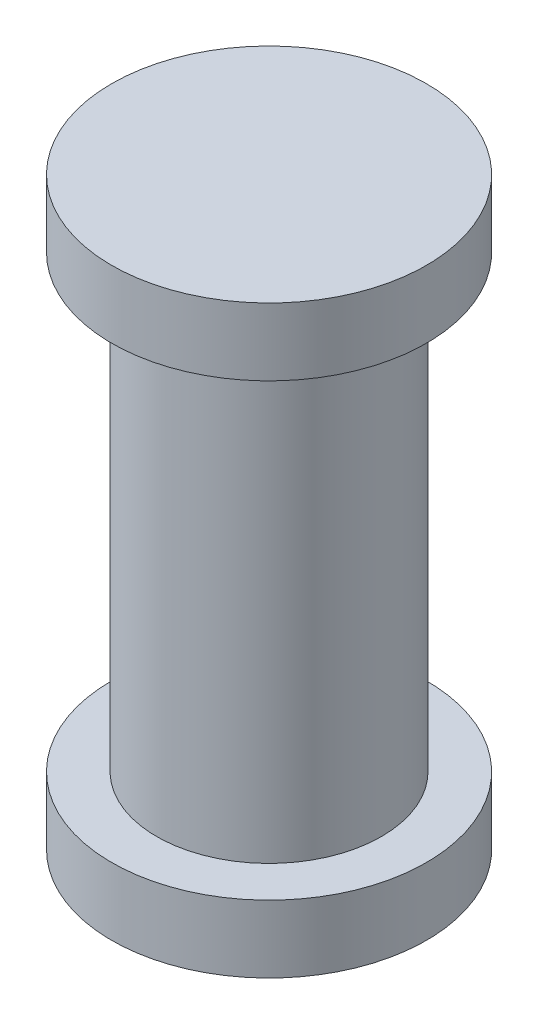
ISO-10303-21;
HEADER;
FILE_DESCRIPTION(('STEP AP214'),'2;1');
FILE_NAME('part.step','',(''),(''),'','','');
FILE_SCHEMA(('AUTOMOTIVE_DESIGN { 1 0 10303 214 1 1 1 1 }'));
ENDSEC;
DATA;
#1=APPLICATION_CONTEXT('core data for automotive mechanical design processes');
#2=APPLICATION_PROTOCOL_DEFINITION('international standard','automotive_design',2000,#1);
#3=PRODUCT_CONTEXT('',#1,'mechanical');
#4=PRODUCT('Part','Part','',(#3));
#5=PRODUCT_RELATED_PRODUCT_CATEGORY('part','',(#4));
#6=PRODUCT_DEFINITION_FORMATION('','',#4);
#7=PRODUCT_DEFINITION_CONTEXT('part definition',#1,'design');
#8=PRODUCT_DEFINITION('design','',#6,#7);
#9=PRODUCT_DEFINITION_SHAPE('','',#8);
#10=(LENGTH_UNIT() NAMED_UNIT(*) SI_UNIT(.MILLI.,.METRE.));
#11=(NAMED_UNIT(*) PLANE_ANGLE_UNIT() SI_UNIT($,.RADIAN.));
#12=(NAMED_UNIT(*) SI_UNIT($,.STERADIAN.) SOLID_ANGLE_UNIT());
#13=UNCERTAINTY_MEASURE_WITH_UNIT(LENGTH_MEASURE(1.E-05),#10,'distance_accuracy_value','');
#14=(GEOMETRIC_REPRESENTATION_CONTEXT(3) GLOBAL_UNCERTAINTY_ASSIGNED_CONTEXT((#13)) GLOBAL_UNIT_ASSIGNED_CONTEXT((#10,
#11,#12)) REPRESENTATION_CONTEXT('',''));
#15=CARTESIAN_POINT('',(0.,0.,0.));
#16=DIRECTION('',(0.,0.,1.));
#17=DIRECTION('',(1.,0.,0.));
#18=AXIS2_PLACEMENT_3D('',#15,#16,#17);
#19=CARTESIAN_POINT('',(0.,0.,0.));
#20=DIRECTION('',(0.,1.,0.));
#21=DIRECTION('',(-1.,0.,0.));
#22=AXIS2_PLACEMENT_3D('',#19,#20,#21);
#23=PLANE('',#22);
#24=CARTESIAN_POINT('',(0.,0.,0.));
#25=DIRECTION('',(0.,1.,0.));
#26=DIRECTION('',(-1.,0.,0.));
#27=AXIS2_PLACEMENT_3D('',#24,#25,#26);
#28=CIRCLE('',#27,7.);
#29=CARTESIAN_POINT('',(-7.,0.,0.));
#30=VERTEX_POINT('',#29);
#31=EDGE_CURVE('E10',#30,#30,#28,.T.);
#32=ORIENTED_EDGE('',*,*,#31,.F.);
#33=EDGE_LOOP('',(#32));
#34=FACE_BOUND('',#33,.T.);
#35=ADVANCED_FACE('F35',(#34),#23,.F.);
#36=CARTESIAN_POINT('',(0.,26.,0.));
#37=DIRECTION('',(0.,1.,0.));
#38=DIRECTION('',(-1.,0.,0.));
#39=AXIS2_PLACEMENT_3D('',#36,#37,#38);
#40=CYLINDRICAL_SURFACE('',#39,7.);
#41=CARTESIAN_POINT('',(0.,3.,0.));
#42=DIRECTION('',(0.,1.,0.));
#43=DIRECTION('',(-1.,0.,0.));
#44=AXIS2_PLACEMENT_3D('',#41,#42,#43);
#45=CIRCLE('',#44,7.);
#46=CARTESIAN_POINT('',(-7.,3.,0.));
#47=VERTEX_POINT('',#46);
#48=EDGE_CURVE('E41',#47,#47,#45,.T.);
#49=ORIENTED_EDGE('',*,*,#48,.F.);
#50=EDGE_LOOP('',(#49));
#51=FACE_BOUND('',#50,.T.);
#52=ORIENTED_EDGE('',*,*,#31,.T.);
#53=EDGE_LOOP('',(#52));
#54=FACE_BOUND('',#53,.T.);
#55=ADVANCED_FACE('F83',(#51,#54),#40,.T.);
#56=CARTESIAN_POINT('',(7.,3.,0.));
#57=DIRECTION('',(0.,-1.,0.));
#58=DIRECTION('',(1.,0.,0.));
#59=AXIS2_PLACEMENT_3D('',#56,#57,#58);
#60=PLANE('',#59);
#61=CARTESIAN_POINT('',(0.,3.,0.));
#62=DIRECTION('',(0.,1.,0.));
#63=DIRECTION('',(-1.,0.,0.));
#64=AXIS2_PLACEMENT_3D('',#61,#62,#63);
#65=CIRCLE('',#64,5.);
#66=CARTESIAN_POINT('',(-5.,3.,0.));
#67=VERTEX_POINT('',#66);
#68=EDGE_CURVE('E45',#67,#67,#65,.T.);
#69=ORIENTED_EDGE('',*,*,#68,.F.);
#70=EDGE_LOOP('',(#69));
#71=FACE_BOUND('',#70,.T.);
#72=ORIENTED_EDGE('',*,*,#48,.T.);
#73=EDGE_LOOP('',(#72));
#74=FACE_BOUND('',#73,.T.);
#75=ADVANCED_FACE('F78',(#71,#74),#60,.F.);
#76=CARTESIAN_POINT('',(0.,26.,0.));
#77=DIRECTION('',(0.,1.,0.));
#78=DIRECTION('',(-1.,0.,0.));
#79=AXIS2_PLACEMENT_3D('',#76,#77,#78);
#80=CYLINDRICAL_SURFACE('',#79,5.);
#81=CARTESIAN_POINT('',(0.,23.,0.));
#82=DIRECTION('',(0.,1.,0.));
#83=DIRECTION('',(-1.,0.,0.));
#84=AXIS2_PLACEMENT_3D('',#81,#82,#83);
#85=CIRCLE('',#84,5.);
#86=CARTESIAN_POINT('',(-5.,23.,0.));
#87=VERTEX_POINT('',#86);
#88=EDGE_CURVE('E49',#87,#87,#85,.T.);
#89=ORIENTED_EDGE('',*,*,#88,.F.);
#90=EDGE_LOOP('',(#89));
#91=FACE_BOUND('',#90,.T.);
#92=ORIENTED_EDGE('',*,*,#68,.T.);
#93=EDGE_LOOP('',(#92));
#94=FACE_BOUND('',#93,.T.);
#95=ADVANCED_FACE('F72',(#91,#94),#80,.T.);
#96=CARTESIAN_POINT('',(5.,23.,0.));
#97=DIRECTION('',(0.,1.,0.));
#98=DIRECTION('',(-1.,0.,0.));
#99=AXIS2_PLACEMENT_3D('',#96,#97,#98);
#100=PLANE('',#99);
#101=CARTESIAN_POINT('',(0.,23.,0.));
#102=DIRECTION('',(0.,1.,0.));
#103=DIRECTION('',(-1.,0.,0.));
#104=AXIS2_PLACEMENT_3D('',#101,#102,#103);
#105=CIRCLE('',#104,7.00000000000001);
#106=CARTESIAN_POINT('',(-7.00000000000001,23.,0.));
#107=VERTEX_POINT('',#106);
#108=EDGE_CURVE('E54',#107,#107,#105,.T.);
#109=ORIENTED_EDGE('',*,*,#108,.F.);
#110=EDGE_LOOP('',(#109));
#111=FACE_BOUND('',#110,.T.);
#112=ORIENTED_EDGE('',*,*,#88,.T.);
#113=EDGE_LOOP('',(#112));
#114=FACE_BOUND('',#113,.T.);
#115=ADVANCED_FACE('F66',(#111,#114),#100,.F.);
#116=CARTESIAN_POINT('',(0.,26.,0.));
#117=DIRECTION('',(0.,1.,0.));
#118=DIRECTION('',(-1.,0.,0.));
#119=AXIS2_PLACEMENT_3D('',#116,#117,#118);
#120=CYLINDRICAL_SURFACE('',#119,7.00000000000001);
#121=CARTESIAN_POINT('',(0.,26.,0.));
#122=DIRECTION('',(0.,1.,0.));
#123=DIRECTION('',(-1.,0.,0.));
#124=AXIS2_PLACEMENT_3D('',#121,#122,#123);
#125=CIRCLE('',#124,7.00000000000001);
#126=CARTESIAN_POINT('',(-7.00000000000001,26.,0.));
#127=VERTEX_POINT('',#126);
#128=EDGE_CURVE('E57',#127,#127,#125,.T.);
#129=ORIENTED_EDGE('',*,*,#128,.F.);
#130=EDGE_LOOP('',(#129));
#131=FACE_BOUND('',#130,.T.);
#132=ORIENTED_EDGE('',*,*,#108,.T.);
#133=EDGE_LOOP('',(#132));
#134=FACE_BOUND('',#133,.T.);
#135=ADVANCED_FACE('F63',(#131,#134),#120,.T.);
#136=CARTESIAN_POINT('',(7.00000000000001,26.,0.));
#137=DIRECTION('',(0.,-1.,0.));
#138=DIRECTION('',(1.,0.,0.));
#139=AXIS2_PLACEMENT_3D('',#136,#137,#138);
#140=PLANE('',#139);
#141=ORIENTED_EDGE('',*,*,#128,.T.);
#142=EDGE_LOOP('',(#141));
#143=FACE_BOUND('',#142,.T.);
#144=ADVANCED_FACE('F61',(#143),#140,.F.);
#145=CLOSED_SHELL('',(#35,#55,#75,#95,#115,#135,#144));
#146=MANIFOLD_SOLID_BREP('B2',#145);
#147=ADVANCED_BREP_SHAPE_REPRESENTATION('',(#18,#146),#14);
#148=SHAPE_DEFINITION_REPRESENTATION(#9,#147);
ENDSEC;
END-ISO-10303-21;
